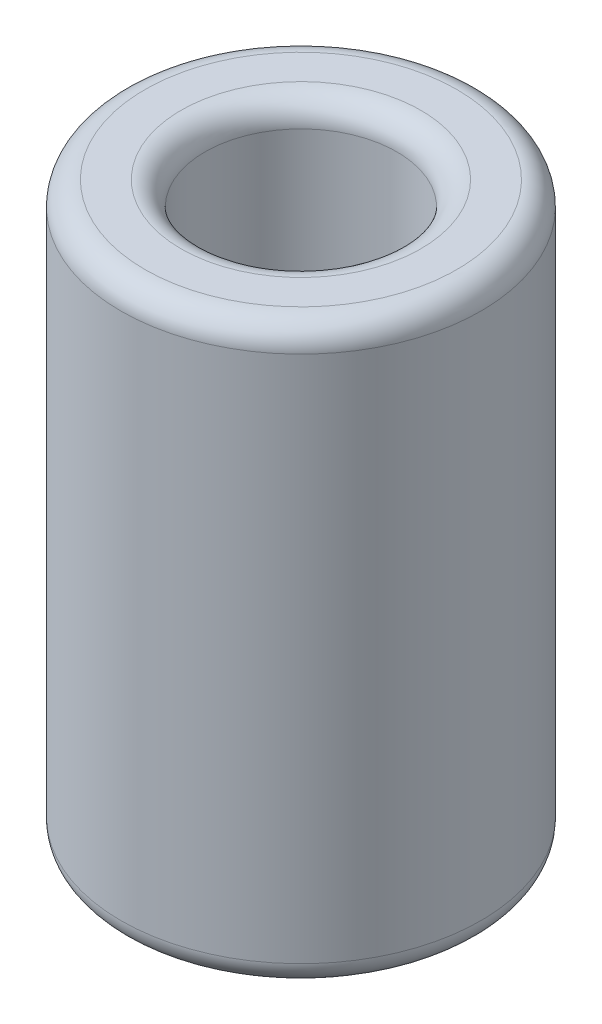
ISO-10303-21;
HEADER;
FILE_DESCRIPTION(('STEP AP214'),'2;1');
FILE_NAME('part.step','',(''),(''),'','','');
FILE_SCHEMA(('AUTOMOTIVE_DESIGN { 1 0 10303 214 1 1 1 1 }'));
ENDSEC;
DATA;
#1=APPLICATION_CONTEXT('core data for automotive mechanical design processes');
#2=APPLICATION_PROTOCOL_DEFINITION('international standard','automotive_design',2000,#1);
#3=PRODUCT_CONTEXT('',#1,'mechanical');
#4=PRODUCT('Part','Part','',(#3));
#5=PRODUCT_RELATED_PRODUCT_CATEGORY('part','',(#4));
#6=PRODUCT_DEFINITION_FORMATION('','',#4);
#7=PRODUCT_DEFINITION_CONTEXT('part definition',#1,'design');
#8=PRODUCT_DEFINITION('design','',#6,#7);
#9=PRODUCT_DEFINITION_SHAPE('','',#8);
#10=(LENGTH_UNIT() NAMED_UNIT(*) SI_UNIT(.MILLI.,.METRE.));
#11=(NAMED_UNIT(*) PLANE_ANGLE_UNIT() SI_UNIT($,.RADIAN.));
#12=(NAMED_UNIT(*) SI_UNIT($,.STERADIAN.) SOLID_ANGLE_UNIT());
#13=UNCERTAINTY_MEASURE_WITH_UNIT(LENGTH_MEASURE(1.E-05),#10,'distance_accuracy_value','');
#14=(GEOMETRIC_REPRESENTATION_CONTEXT(3) GLOBAL_UNCERTAINTY_ASSIGNED_CONTEXT((#13)) GLOBAL_UNIT_ASSIGNED_CONTEXT((#10,
#11,#12)) REPRESENTATION_CONTEXT('',''));
#15=CARTESIAN_POINT('',(0.,0.,0.));
#16=DIRECTION('',(0.,0.,1.));
#17=DIRECTION('',(1.,0.,0.));
#18=AXIS2_PLACEMENT_3D('',#15,#16,#17);
#19=CARTESIAN_POINT('',(0.,24.,0.));
#20=DIRECTION('',(0.,1.,0.));
#21=DIRECTION('',(0.,0.,1.));
#22=AXIS2_PLACEMENT_3D('',#19,#20,#21);
#23=PLANE('',#22);
#24=CARTESIAN_POINT('',(0.,24.,0.));
#25=DIRECTION('',(0.,1.,0.));
#26=DIRECTION('',(0.,0.,1.));
#27=AXIS2_PLACEMENT_3D('',#24,#25,#26);
#28=CIRCLE('',#27,5.);
#29=CARTESIAN_POINT('',(0.,24.,5.));
#30=VERTEX_POINT('',#29);
#31=EDGE_CURVE('E42',#30,#30,#28,.F.);
#32=ORIENTED_EDGE('',*,*,#31,.T.);
#33=EDGE_LOOP('',(#32));
#34=FACE_BOUND('',#33,.T.);
#35=CARTESIAN_POINT('',(0.,24.,0.));
#36=DIRECTION('',(0.,1.,0.));
#37=DIRECTION('',(0.,0.,1.));
#38=AXIS2_PLACEMENT_3D('',#35,#36,#37);
#39=CIRCLE('',#38,6.5);
#40=CARTESIAN_POINT('',(0.,24.,6.5));
#41=VERTEX_POINT('',#40);
#42=EDGE_CURVE('E46',#41,#41,#39,.T.);
#43=ORIENTED_EDGE('',*,*,#42,.T.);
#44=EDGE_LOOP('',(#43));
#45=FACE_BOUND('',#44,.T.);
#46=ADVANCED_FACE('F31',(#34,#45),#23,.T.);
#47=CARTESIAN_POINT('',(0.,0.,0.));
#48=DIRECTION('',(0.,1.,0.));
#49=DIRECTION('',(0.,0.,1.));
#50=AXIS2_PLACEMENT_3D('',#47,#48,#49);
#51=PLANE('',#50);
#52=CARTESIAN_POINT('',(0.,0.,0.));
#53=DIRECTION('',(0.,1.,0.));
#54=DIRECTION('',(0.,0.,1.));
#55=AXIS2_PLACEMENT_3D('',#52,#53,#54);
#56=CIRCLE('',#55,5.);
#57=CARTESIAN_POINT('',(0.,0.,5.));
#58=VERTEX_POINT('',#57);
#59=EDGE_CURVE('E57',#58,#58,#56,.T.);
#60=ORIENTED_EDGE('',*,*,#59,.T.);
#61=EDGE_LOOP('',(#60));
#62=FACE_BOUND('',#61,.T.);
#63=CARTESIAN_POINT('',(0.,0.,0.));
#64=DIRECTION('',(0.,1.,0.));
#65=DIRECTION('',(0.,0.,1.));
#66=AXIS2_PLACEMENT_3D('',#63,#64,#65);
#67=CIRCLE('',#66,6.5);
#68=CARTESIAN_POINT('',(0.,0.,6.5));
#69=VERTEX_POINT('',#68);
#70=EDGE_CURVE('E60',#69,#69,#67,.F.);
#71=ORIENTED_EDGE('',*,*,#70,.T.);
#72=EDGE_LOOP('',(#71));
#73=FACE_BOUND('',#72,.T.);
#74=ADVANCED_FACE('F64',(#62,#73),#51,.F.);
#75=CARTESIAN_POINT('',(0.,24.,0.));
#76=DIRECTION('',(0.,-1.,0.));
#77=DIRECTION('',(0.,0.,-1.));
#78=AXIS2_PLACEMENT_3D('',#75,#76,#77);
#79=CYLINDRICAL_SURFACE('',#78,7.5);
#80=CARTESIAN_POINT('',(0.,1.,0.));
#81=DIRECTION('',(0.,1.,0.));
#82=DIRECTION('',(0.,0.,1.));
#83=AXIS2_PLACEMENT_3D('',#80,#81,#82);
#84=CIRCLE('',#83,7.5);
#85=CARTESIAN_POINT('',(0.,1.,7.5));
#86=VERTEX_POINT('',#85);
#87=EDGE_CURVE('E10',#86,#86,#84,.T.);
#88=ORIENTED_EDGE('',*,*,#87,.T.);
#89=EDGE_LOOP('',(#88));
#90=FACE_BOUND('',#89,.T.);
#91=CARTESIAN_POINT('',(0.,23.,0.));
#92=DIRECTION('',(0.,1.,0.));
#93=DIRECTION('',(0.,0.,1.));
#94=AXIS2_PLACEMENT_3D('',#91,#92,#93);
#95=CIRCLE('',#94,7.5);
#96=CARTESIAN_POINT('',(0.,23.,7.5));
#97=VERTEX_POINT('',#96);
#98=EDGE_CURVE('E38',#97,#97,#95,.F.);
#99=ORIENTED_EDGE('',*,*,#98,.T.);
#100=EDGE_LOOP('',(#99));
#101=FACE_BOUND('',#100,.T.);
#102=ADVANCED_FACE('F84',(#90,#101),#79,.T.);
#103=CARTESIAN_POINT('',(0.,24.,0.));
#104=DIRECTION('',(0.,-1.,0.));
#105=DIRECTION('',(0.,0.,-1.));
#106=AXIS2_PLACEMENT_3D('',#103,#104,#105);
#107=CYLINDRICAL_SURFACE('',#106,4.);
#108=CARTESIAN_POINT('',(0.,1.,0.));
#109=DIRECTION('',(0.,1.,0.));
#110=DIRECTION('',(0.,0.,1.));
#111=AXIS2_PLACEMENT_3D('',#108,#109,#110);
#112=CIRCLE('',#111,4.);
#113=CARTESIAN_POINT('',(0.,1.,4.));
#114=VERTEX_POINT('',#113);
#115=EDGE_CURVE('E51',#114,#114,#112,.F.);
#116=ORIENTED_EDGE('',*,*,#115,.T.);
#117=EDGE_LOOP('',(#116));
#118=FACE_BOUND('',#117,.T.);
#119=CARTESIAN_POINT('',(0.,23.,0.));
#120=DIRECTION('',(0.,1.,0.));
#121=DIRECTION('',(0.,0.,1.));
#122=AXIS2_PLACEMENT_3D('',#119,#120,#121);
#123=CIRCLE('',#122,4.);
#124=CARTESIAN_POINT('',(0.,23.,4.));
#125=VERTEX_POINT('',#124);
#126=EDGE_CURVE('E54',#125,#125,#123,.T.);
#127=ORIENTED_EDGE('',*,*,#126,.T.);
#128=EDGE_LOOP('',(#127));
#129=FACE_BOUND('',#128,.T.);
#130=ADVANCED_FACE('F89',(#118,#129),#107,.F.);
#131=CARTESIAN_POINT('',(0.,1.,0.));
#132=DIRECTION('',(0.,1.,0.));
#133=DIRECTION('',(0.,0.,1.));
#134=AXIS2_PLACEMENT_3D('',#131,#132,#133);
#135=TOROIDAL_SURFACE('',#134,5.,1.);
#136=ORIENTED_EDGE('',*,*,#115,.F.);
#137=EDGE_LOOP('',(#136));
#138=FACE_BOUND('',#137,.T.);
#139=ORIENTED_EDGE('',*,*,#59,.F.);
#140=EDGE_LOOP('',(#139));
#141=FACE_BOUND('',#140,.T.);
#142=ADVANCED_FACE('F75',(#138,#141),#135,.T.);
#143=CARTESIAN_POINT('',(0.,23.,0.));
#144=DIRECTION('',(0.,1.,0.));
#145=DIRECTION('',(0.,0.,1.));
#146=AXIS2_PLACEMENT_3D('',#143,#144,#145);
#147=TOROIDAL_SURFACE('',#146,5.,1.);
#148=ORIENTED_EDGE('',*,*,#31,.F.);
#149=EDGE_LOOP('',(#148));
#150=FACE_BOUND('',#149,.T.);
#151=ORIENTED_EDGE('',*,*,#126,.F.);
#152=EDGE_LOOP('',(#151));
#153=FACE_BOUND('',#152,.T.);
#154=ADVANCED_FACE('F69',(#150,#153),#147,.T.);
#155=CARTESIAN_POINT('',(0.,1.,0.));
#156=DIRECTION('',(0.,1.,0.));
#157=DIRECTION('',(0.,0.,1.));
#158=AXIS2_PLACEMENT_3D('',#155,#156,#157);
#159=TOROIDAL_SURFACE('',#158,6.5,1.);
#160=ORIENTED_EDGE('',*,*,#70,.F.);
#161=EDGE_LOOP('',(#160));
#162=FACE_BOUND('',#161,.T.);
#163=ORIENTED_EDGE('',*,*,#87,.F.);
#164=EDGE_LOOP('',(#163));
#165=FACE_BOUND('',#164,.T.);
#166=ADVANCED_FACE('F66',(#162,#165),#159,.T.);
#167=CARTESIAN_POINT('',(0.,23.,0.));
#168=DIRECTION('',(0.,1.,0.));
#169=DIRECTION('',(0.,0.,1.));
#170=AXIS2_PLACEMENT_3D('',#167,#168,#169);
#171=TOROIDAL_SURFACE('',#170,6.5,1.);
#172=ORIENTED_EDGE('',*,*,#98,.F.);
#173=EDGE_LOOP('',(#172));
#174=FACE_BOUND('',#173,.T.);
#175=ORIENTED_EDGE('',*,*,#42,.F.);
#176=EDGE_LOOP('',(#175));
#177=FACE_BOUND('',#176,.T.);
#178=ADVANCED_FACE('F33',(#174,#177),#171,.T.);
#179=CLOSED_SHELL('',(#46,#74,#102,#130,#142,#154,#166,#178));
#180=MANIFOLD_SOLID_BREP('B2',#179);
#181=ADVANCED_BREP_SHAPE_REPRESENTATION('',(#18,#180),#14);
#182=SHAPE_DEFINITION_REPRESENTATION(#9,#181);
ENDSEC;
END-ISO-10303-21;
